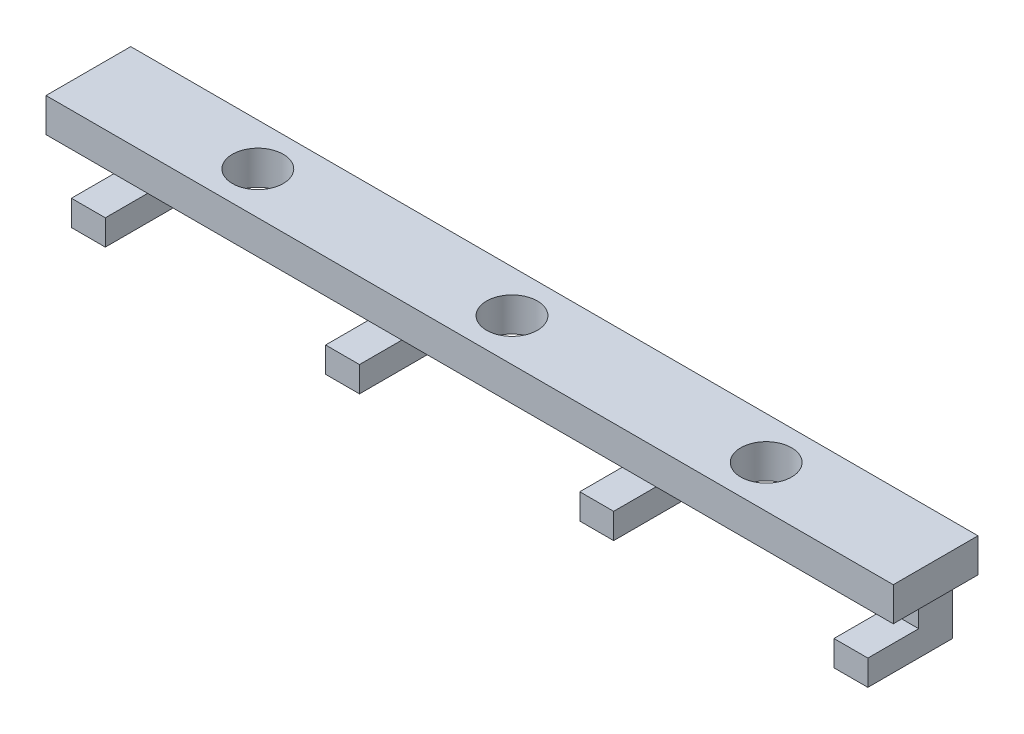
ISO-10303-21;
HEADER;
FILE_DESCRIPTION(('STEP AP214'),'2;1');
FILE_NAME('part.step','',(''),(''),'','','');
FILE_SCHEMA(('AUTOMOTIVE_DESIGN { 1 0 10303 214 1 1 1 1 }'));
ENDSEC;
DATA;
#1=APPLICATION_CONTEXT('core data for automotive mechanical design processes');
#2=APPLICATION_PROTOCOL_DEFINITION('international standard','automotive_design',2000,#1);
#3=PRODUCT_CONTEXT('',#1,'mechanical');
#4=PRODUCT('Part','Part','',(#3));
#5=PRODUCT_RELATED_PRODUCT_CATEGORY('part','',(#4));
#6=PRODUCT_DEFINITION_FORMATION('','',#4);
#7=PRODUCT_DEFINITION_CONTEXT('part definition',#1,'design');
#8=PRODUCT_DEFINITION('design','',#6,#7);
#9=PRODUCT_DEFINITION_SHAPE('','',#8);
#10=(LENGTH_UNIT() NAMED_UNIT(*) SI_UNIT(.MILLI.,.METRE.));
#11=(NAMED_UNIT(*) PLANE_ANGLE_UNIT() SI_UNIT($,.RADIAN.));
#12=(NAMED_UNIT(*) SI_UNIT($,.STERADIAN.) SOLID_ANGLE_UNIT());
#13=UNCERTAINTY_MEASURE_WITH_UNIT(LENGTH_MEASURE(1.E-05),#10,'distance_accuracy_value','');
#14=(GEOMETRIC_REPRESENTATION_CONTEXT(3) GLOBAL_UNCERTAINTY_ASSIGNED_CONTEXT((#13)) GLOBAL_UNIT_ASSIGNED_CONTEXT((#10,
#11,#12)) REPRESENTATION_CONTEXT('',''));
#15=CARTESIAN_POINT('',(0.,0.,0.));
#16=DIRECTION('',(0.,0.,1.));
#17=DIRECTION('',(1.,0.,0.));
#18=AXIS2_PLACEMENT_3D('',#15,#16,#17);
#19=CARTESIAN_POINT('',(-31.75,2.54,3.175));
#20=DIRECTION('',(0.,0.,-1.));
#21=DIRECTION('',(-1.,0.,0.));
#22=AXIS2_PLACEMENT_3D('',#19,#20,#21);
#23=PLANE('',#22);
#24=DIRECTION('',(1.,0.,0.));
#25=VECTOR('',#24,1.);
#26=CARTESIAN_POINT('',(-31.75,0.,3.175));
#27=LINE('',#26,#25);
#28=CARTESIAN_POINT('',(-31.75,0.,3.175));
#29=VERTEX_POINT('',#28);
#30=CARTESIAN_POINT('',(31.75,0.,3.175));
#31=VERTEX_POINT('',#30);
#32=EDGE_CURVE('E373',#29,#31,#27,.T.);
#33=ORIENTED_EDGE('',*,*,#32,.T.);
#34=DIRECTION('',(0.,-1.,0.));
#35=VECTOR('',#34,1.);
#36=CARTESIAN_POINT('',(31.75,2.54,3.175));
#37=LINE('',#36,#35);
#38=CARTESIAN_POINT('',(31.75,2.54,3.175));
#39=VERTEX_POINT('',#38);
#40=EDGE_CURVE('E379',#39,#31,#37,.T.);
#41=ORIENTED_EDGE('',*,*,#40,.F.);
#42=DIRECTION('',(1.,0.,0.));
#43=VECTOR('',#42,1.);
#44=CARTESIAN_POINT('',(-31.75,2.54,3.175));
#45=LINE('',#44,#43);
#46=CARTESIAN_POINT('',(-31.75,2.54,3.175));
#47=VERTEX_POINT('',#46);
#48=EDGE_CURVE('E377',#47,#39,#45,.T.);
#49=ORIENTED_EDGE('',*,*,#48,.F.);
#50=DIRECTION('',(0.,-1.,0.));
#51=VECTOR('',#50,1.);
#52=CARTESIAN_POINT('',(-31.75,2.54,3.175));
#53=LINE('',#52,#51);
#54=EDGE_CURVE('E391',#47,#29,#53,.T.);
#55=ORIENTED_EDGE('',*,*,#54,.T.);
#56=EDGE_LOOP('',(#33,#41,#49,#55));
#57=FACE_BOUND('',#56,.T.);
#58=ADVANCED_FACE('F42',(#57),#23,.F.);
#59=DIRECTION('',(0.,1.,0.));
#60=VECTOR('',#59,1.);
#61=CARTESIAN_POINT('',(29.845,-5.08,3.175));
#62=LINE('',#61,#60);
#63=CARTESIAN_POINT('',(29.845,-5.08,3.175));
#64=VERTEX_POINT('',#63);
#65=CARTESIAN_POINT('',(29.845,-3.175,3.175));
#66=VERTEX_POINT('',#65);
#67=EDGE_CURVE('E335',#64,#66,#62,.T.);
#68=ORIENTED_EDGE('',*,*,#67,.T.);
#69=DIRECTION('',(1.,0.,0.));
#70=VECTOR('',#69,1.);
#71=CARTESIAN_POINT('',(-31.75,-3.175,3.175));
#72=LINE('',#71,#70);
#73=CARTESIAN_POINT('',(27.305,-3.175,3.175));
#74=VERTEX_POINT('',#73);
#75=EDGE_CURVE('E250',#74,#66,#72,.T.);
#76=ORIENTED_EDGE('',*,*,#75,.F.);
#77=DIRECTION('',(0.,1.,0.));
#78=VECTOR('',#77,1.);
#79=CARTESIAN_POINT('',(27.305,-5.08,3.175));
#80=LINE('',#79,#78);
#81=CARTESIAN_POINT('',(27.305,-5.08,3.175));
#82=VERTEX_POINT('',#81);
#83=EDGE_CURVE('E325',#82,#74,#80,.T.);
#84=ORIENTED_EDGE('',*,*,#83,.F.);
#85=DIRECTION('',(-1.,0.,0.));
#86=VECTOR('',#85,1.);
#87=CARTESIAN_POINT('',(29.845,-5.08,3.175));
#88=LINE('',#87,#86);
#89=EDGE_CURVE('E342',#64,#82,#88,.T.);
#90=ORIENTED_EDGE('',*,*,#89,.F.);
#91=EDGE_LOOP('',(#68,#76,#84,#90));
#92=FACE_BOUND('',#91,.T.);
#93=ADVANCED_FACE('F540',(#92),#23,.F.);
#94=DIRECTION('',(0.,1.,0.));
#95=VECTOR('',#94,1.);
#96=CARTESIAN_POINT('',(10.795,-5.08,3.175));
#97=LINE('',#96,#95);
#98=CARTESIAN_POINT('',(10.795,-5.08,3.175));
#99=VERTEX_POINT('',#98);
#100=CARTESIAN_POINT('',(10.795,-3.175,3.175));
#101=VERTEX_POINT('',#100);
#102=EDGE_CURVE('E309',#99,#101,#97,.T.);
#103=ORIENTED_EDGE('',*,*,#102,.T.);
#104=CARTESIAN_POINT('',(8.255,-3.175,3.175));
#105=VERTEX_POINT('',#104);
#106=EDGE_CURVE('E452',#105,#101,#72,.T.);
#107=ORIENTED_EDGE('',*,*,#106,.F.);
#108=DIRECTION('',(0.,1.,0.));
#109=VECTOR('',#108,1.);
#110=CARTESIAN_POINT('',(8.255,-5.08,3.175));
#111=LINE('',#110,#109);
#112=CARTESIAN_POINT('',(8.255,-5.08,3.175));
#113=VERTEX_POINT('',#112);
#114=EDGE_CURVE('E299',#113,#105,#111,.T.);
#115=ORIENTED_EDGE('',*,*,#114,.F.);
#116=DIRECTION('',(-1.,0.,0.));
#117=VECTOR('',#116,1.);
#118=CARTESIAN_POINT('',(10.795,-5.08,3.175));
#119=LINE('',#118,#117);
#120=EDGE_CURVE('E316',#99,#113,#119,.T.);
#121=ORIENTED_EDGE('',*,*,#120,.F.);
#122=EDGE_LOOP('',(#103,#107,#115,#121));
#123=FACE_BOUND('',#122,.T.);
#124=ADVANCED_FACE('F537',(#123),#23,.F.);
#125=DIRECTION('',(0.,1.,0.));
#126=VECTOR('',#125,1.);
#127=CARTESIAN_POINT('',(-8.255,-5.08,3.175));
#128=LINE('',#127,#126);
#129=CARTESIAN_POINT('',(-8.255,-5.08,3.175));
#130=VERTEX_POINT('',#129);
#131=CARTESIAN_POINT('',(-8.255,-3.175,3.175));
#132=VERTEX_POINT('',#131);
#133=EDGE_CURVE('E281',#130,#132,#128,.T.);
#134=ORIENTED_EDGE('',*,*,#133,.T.);
#135=CARTESIAN_POINT('',(-10.795,-3.175,3.175));
#136=VERTEX_POINT('',#135);
#137=EDGE_CURVE('E248',#136,#132,#72,.T.);
#138=ORIENTED_EDGE('',*,*,#137,.F.);
#139=DIRECTION('',(0.,1.,0.));
#140=VECTOR('',#139,1.);
#141=CARTESIAN_POINT('',(-10.795,-5.08,3.175));
#142=LINE('',#141,#140);
#143=CARTESIAN_POINT('',(-10.795,-5.08,3.175));
#144=VERTEX_POINT('',#143);
#145=EDGE_CURVE('E271',#144,#136,#142,.T.);
#146=ORIENTED_EDGE('',*,*,#145,.F.);
#147=DIRECTION('',(-1.,0.,0.));
#148=VECTOR('',#147,1.);
#149=CARTESIAN_POINT('',(-8.255,-5.08,3.175));
#150=LINE('',#149,#148);
#151=EDGE_CURVE('E289',#130,#144,#150,.T.);
#152=ORIENTED_EDGE('',*,*,#151,.F.);
#153=EDGE_LOOP('',(#134,#138,#146,#152));
#154=FACE_BOUND('',#153,.T.);
#155=ADVANCED_FACE('F539',(#154),#23,.F.);
#156=CARTESIAN_POINT('',(0.,2.54,0.));
#157=DIRECTION('',(0.,-1.,0.));
#158=DIRECTION('',(0.,0.,-1.));
#159=AXIS2_PLACEMENT_3D('',#156,#157,#158);
#160=PLANE('',#159);
#161=DIRECTION('',(0.,0.,-1.));
#162=VECTOR('',#161,1.);
#163=CARTESIAN_POINT('',(31.75,2.54,3.175));
#164=LINE('',#163,#162);
#165=CARTESIAN_POINT('',(31.75,2.54,-3.175));
#166=VERTEX_POINT('',#165);
#167=EDGE_CURVE('E369',#39,#166,#164,.T.);
#168=ORIENTED_EDGE('',*,*,#167,.T.);
#169=DIRECTION('',(-1.,0.,0.));
#170=VECTOR('',#169,1.);
#171=CARTESIAN_POINT('',(-31.75,2.54,-3.175));
#172=LINE('',#171,#170);
#173=CARTESIAN_POINT('',(-31.75,2.54,-3.175));
#174=VERTEX_POINT('',#173);
#175=EDGE_CURVE('E372',#166,#174,#172,.T.);
#176=ORIENTED_EDGE('',*,*,#175,.T.);
#177=DIRECTION('',(0.,0.,1.));
#178=VECTOR('',#177,1.);
#179=CARTESIAN_POINT('',(-31.75,2.54,3.175));
#180=LINE('',#179,#178);
#181=EDGE_CURVE('E375',#174,#47,#180,.T.);
#182=ORIENTED_EDGE('',*,*,#181,.T.);
#183=ORIENTED_EDGE('',*,*,#48,.T.);
#184=EDGE_LOOP('',(#168,#176,#182,#183));
#185=FACE_BOUND('',#184,.T.);
#186=CARTESIAN_POINT('',(0.,2.54,0.));
#187=DIRECTION('',(0.,1.,0.));
#188=DIRECTION('',(0.,0.,1.));
#189=AXIS2_PLACEMENT_3D('',#186,#187,#188);
#190=CIRCLE('',#189,1.905);
#191=CARTESIAN_POINT('',(0.,2.54,1.905));
#192=VERTEX_POINT('',#191);
#193=EDGE_CURVE('E363',#192,#192,#190,.T.);
#194=ORIENTED_EDGE('',*,*,#193,.F.);
#195=EDGE_LOOP('',(#194));
#196=FACE_BOUND('',#195,.T.);
#197=CARTESIAN_POINT('',(-19.05,2.54,0.));
#198=DIRECTION('',(0.,1.,0.));
#199=DIRECTION('',(0.,0.,1.));
#200=AXIS2_PLACEMENT_3D('',#197,#198,#199);
#201=CIRCLE('',#200,1.905);
#202=CARTESIAN_POINT('',(-19.05,2.54,1.905));
#203=VERTEX_POINT('',#202);
#204=EDGE_CURVE('E357',#203,#203,#201,.T.);
#205=ORIENTED_EDGE('',*,*,#204,.F.);
#206=EDGE_LOOP('',(#205));
#207=FACE_BOUND('',#206,.T.);
#208=CARTESIAN_POINT('',(19.05,2.54,0.));
#209=DIRECTION('',(0.,1.,0.));
#210=DIRECTION('',(0.,0.,-1.));
#211=AXIS2_PLACEMENT_3D('',#208,#209,#210);
#212=CIRCLE('',#211,1.905);
#213=CARTESIAN_POINT('',(19.05,2.54,-1.905));
#214=VERTEX_POINT('',#213);
#215=EDGE_CURVE('E351',#214,#214,#212,.T.);
#216=ORIENTED_EDGE('',*,*,#215,.F.);
#217=EDGE_LOOP('',(#216));
#218=FACE_BOUND('',#217,.T.);
#219=ADVANCED_FACE('F497',(#185,#196,#207,#218),#160,.F.);
#220=CARTESIAN_POINT('',(0.,0.,0.));
#221=DIRECTION('',(0.,-1.,0.));
#222=DIRECTION('',(0.,0.,-1.));
#223=AXIS2_PLACEMENT_3D('',#220,#221,#222);
#224=PLANE('',#223);
#225=CARTESIAN_POINT('',(0.,0.,0.));
#226=DIRECTION('',(0.,1.,0.));
#227=DIRECTION('',(0.,0.,1.));
#228=AXIS2_PLACEMENT_3D('',#225,#226,#227);
#229=CIRCLE('',#228,1.905);
#230=CARTESIAN_POINT('',(0.,0.,1.905));
#231=VERTEX_POINT('',#230);
#232=EDGE_CURVE('E360',#231,#231,#229,.T.);
#233=ORIENTED_EDGE('',*,*,#232,.T.);
#234=EDGE_LOOP('',(#233));
#235=FACE_BOUND('',#234,.T.);
#236=CARTESIAN_POINT('',(19.05,0.,0.));
#237=DIRECTION('',(0.,1.,0.));
#238=DIRECTION('',(0.,0.,-1.));
#239=AXIS2_PLACEMENT_3D('',#236,#237,#238);
#240=CIRCLE('',#239,1.905);
#241=CARTESIAN_POINT('',(19.05,0.,-1.905));
#242=VERTEX_POINT('',#241);
#243=EDGE_CURVE('E270',#242,#242,#240,.T.);
#244=ORIENTED_EDGE('',*,*,#243,.T.);
#245=EDGE_LOOP('',(#244));
#246=FACE_BOUND('',#245,.T.);
#247=CARTESIAN_POINT('',(-19.05,0.,0.));
#248=DIRECTION('',(0.,1.,0.));
#249=DIRECTION('',(0.,0.,1.));
#250=AXIS2_PLACEMENT_3D('',#247,#248,#249);
#251=CIRCLE('',#250,1.905);
#252=CARTESIAN_POINT('',(-19.05,0.,1.905));
#253=VERTEX_POINT('',#252);
#254=EDGE_CURVE('E354',#253,#253,#251,.T.);
#255=ORIENTED_EDGE('',*,*,#254,.T.);
#256=EDGE_LOOP('',(#255));
#257=FACE_BOUND('',#256,.T.);
#258=DIRECTION('',(0.,0.,-1.));
#259=VECTOR('',#258,1.);
#260=CARTESIAN_POINT('',(-10.795,0.,-3.175));
#261=LINE('',#260,#259);
#262=CARTESIAN_POINT('',(-10.795,0.,-0.634999999999999));
#263=VERTEX_POINT('',#262);
#264=CARTESIAN_POINT('',(-10.795,0.,-3.175));
#265=VERTEX_POINT('',#264);
#266=EDGE_CURVE('E288',#263,#265,#261,.T.);
#267=ORIENTED_EDGE('',*,*,#266,.F.);
#268=DIRECTION('',(-1.,0.,0.));
#269=VECTOR('',#268,1.);
#270=CARTESIAN_POINT('',(-31.75,0.,-0.634999999999999));
#271=LINE('',#270,#269);
#272=CARTESIAN_POINT('',(-8.255,0.,-0.634999999999999));
#273=VERTEX_POINT('',#272);
#274=EDGE_CURVE('E413',#273,#263,#271,.T.);
#275=ORIENTED_EDGE('',*,*,#274,.F.);
#276=DIRECTION('',(0.,0.,1.));
#277=VECTOR('',#276,1.);
#278=CARTESIAN_POINT('',(-8.255,0.,-3.175));
#279=LINE('',#278,#277);
#280=CARTESIAN_POINT('',(-8.255,0.,-3.175));
#281=VERTEX_POINT('',#280);
#282=EDGE_CURVE('E285',#281,#273,#279,.T.);
#283=ORIENTED_EDGE('',*,*,#282,.F.);
#284=DIRECTION('',(-1.,0.,0.));
#285=VECTOR('',#284,1.);
#286=CARTESIAN_POINT('',(-31.75,0.,-3.175));
#287=LINE('',#286,#285);
#288=CARTESIAN_POINT('',(8.255,0.,-3.175));
#289=VERTEX_POINT('',#288);
#290=EDGE_CURVE('E473',#289,#281,#287,.T.);
#291=ORIENTED_EDGE('',*,*,#290,.F.);
#292=DIRECTION('',(0.,0.,-1.));
#293=VECTOR('',#292,1.);
#294=CARTESIAN_POINT('',(8.255,0.,-3.175));
#295=LINE('',#294,#293);
#296=CARTESIAN_POINT('',(8.255,0.,-0.634999999999999));
#297=VERTEX_POINT('',#296);
#298=EDGE_CURVE('E275',#297,#289,#295,.T.);
#299=ORIENTED_EDGE('',*,*,#298,.F.);
#300=CARTESIAN_POINT('',(10.795,0.,-0.634999999999999));
#301=VERTEX_POINT('',#300);
#302=EDGE_CURVE('E519',#301,#297,#271,.T.);
#303=ORIENTED_EDGE('',*,*,#302,.F.);
#304=DIRECTION('',(0.,0.,1.));
#305=VECTOR('',#304,1.);
#306=CARTESIAN_POINT('',(10.795,0.,-3.175));
#307=LINE('',#306,#305);
#308=CARTESIAN_POINT('',(10.795,0.,-3.175));
#309=VERTEX_POINT('',#308);
#310=EDGE_CURVE('E313',#309,#301,#307,.T.);
#311=ORIENTED_EDGE('',*,*,#310,.F.);
#312=CARTESIAN_POINT('',(27.305,0.,-3.175));
#313=VERTEX_POINT('',#312);
#314=EDGE_CURVE('E386',#313,#309,#287,.T.);
#315=ORIENTED_EDGE('',*,*,#314,.F.);
#316=DIRECTION('',(0.,0.,-1.));
#317=VECTOR('',#316,1.);
#318=CARTESIAN_POINT('',(27.305,0.,-3.175));
#319=LINE('',#318,#317);
#320=CARTESIAN_POINT('',(27.305,0.,-0.634999999999999));
#321=VERTEX_POINT('',#320);
#322=EDGE_CURVE('E303',#321,#313,#319,.T.);
#323=ORIENTED_EDGE('',*,*,#322,.F.);
#324=CARTESIAN_POINT('',(29.845,0.,-0.634999999999999));
#325=VERTEX_POINT('',#324);
#326=EDGE_CURVE('E415',#325,#321,#271,.T.);
#327=ORIENTED_EDGE('',*,*,#326,.F.);
#328=DIRECTION('',(0.,0.,1.));
#329=VECTOR('',#328,1.);
#330=CARTESIAN_POINT('',(29.845,0.,-3.175));
#331=LINE('',#330,#329);
#332=CARTESIAN_POINT('',(29.845,0.,-3.175));
#333=VERTEX_POINT('',#332);
#334=EDGE_CURVE('E339',#333,#325,#331,.T.);
#335=ORIENTED_EDGE('',*,*,#334,.F.);
#336=CARTESIAN_POINT('',(31.75,0.,-3.175));
#337=VERTEX_POINT('',#336);
#338=EDGE_CURVE('E382',#337,#333,#287,.T.);
#339=ORIENTED_EDGE('',*,*,#338,.F.);
#340=DIRECTION('',(0.,0.,-1.));
#341=VECTOR('',#340,1.);
#342=CARTESIAN_POINT('',(31.75,0.,3.175));
#343=LINE('',#342,#341);
#344=EDGE_CURVE('E366',#31,#337,#343,.T.);
#345=ORIENTED_EDGE('',*,*,#344,.F.);
#346=ORIENTED_EDGE('',*,*,#32,.F.);
#347=DIRECTION('',(0.,0.,1.));
#348=VECTOR('',#347,1.);
#349=CARTESIAN_POINT('',(-31.75,0.,3.175));
#350=LINE('',#349,#348);
#351=CARTESIAN_POINT('',(-31.75,0.,-3.175));
#352=VERTEX_POINT('',#351);
#353=EDGE_CURVE('E385',#352,#29,#350,.T.);
#354=ORIENTED_EDGE('',*,*,#353,.F.);
#355=CARTESIAN_POINT('',(-29.845,0.,-3.175));
#356=VERTEX_POINT('',#355);
#357=EDGE_CURVE('E381',#356,#352,#287,.T.);
#358=ORIENTED_EDGE('',*,*,#357,.F.);
#359=DIRECTION('',(0.,0.,-1.));
#360=VECTOR('',#359,1.);
#361=CARTESIAN_POINT('',(-29.845,0.,-3.175));
#362=LINE('',#361,#360);
#363=CARTESIAN_POINT('',(-29.845,0.,-0.634999999999999));
#364=VERTEX_POINT('',#363);
#365=EDGE_CURVE('E291',#364,#356,#362,.T.);
#366=ORIENTED_EDGE('',*,*,#365,.F.);
#367=CARTESIAN_POINT('',(-27.305,0.,-0.634999999999999));
#368=VERTEX_POINT('',#367);
#369=EDGE_CURVE('E403',#368,#364,#271,.T.);
#370=ORIENTED_EDGE('',*,*,#369,.F.);
#371=DIRECTION('',(0.,0.,1.));
#372=VECTOR('',#371,1.);
#373=CARTESIAN_POINT('',(-27.305,0.,-3.175));
#374=LINE('',#373,#372);
#375=CARTESIAN_POINT('',(-27.305,0.,-3.175));
#376=VERTEX_POINT('',#375);
#377=EDGE_CURVE('E262',#376,#368,#374,.T.);
#378=ORIENTED_EDGE('',*,*,#377,.F.);
#379=EDGE_CURVE('E479',#265,#376,#287,.T.);
#380=ORIENTED_EDGE('',*,*,#379,.F.);
#381=EDGE_LOOP('',(#267,#275,#283,#291,#299,#303,#311,#315,#323,#327,#335,#339,#345,#346,#354,
#358,#366,#370,#378,#380));
#382=FACE_BOUND('',#381,.T.);
#383=ADVANCED_FACE('F409',(#235,#246,#257,#382),#224,.T.);
#384=CARTESIAN_POINT('',(31.75,2.54,3.175));
#385=DIRECTION('',(-1.,0.,0.));
#386=DIRECTION('',(0.,0.,1.));
#387=AXIS2_PLACEMENT_3D('',#384,#385,#386);
#388=PLANE('',#387);
#389=ORIENTED_EDGE('',*,*,#344,.T.);
#390=DIRECTION('',(0.,-1.,0.));
#391=VECTOR('',#390,1.);
#392=CARTESIAN_POINT('',(31.75,2.54,-3.175));
#393=LINE('',#392,#391);
#394=EDGE_CURVE('E397',#166,#337,#393,.T.);
#395=ORIENTED_EDGE('',*,*,#394,.F.);
#396=ORIENTED_EDGE('',*,*,#167,.F.);
#397=ORIENTED_EDGE('',*,*,#40,.T.);
#398=EDGE_LOOP('',(#389,#395,#396,#397));
#399=FACE_BOUND('',#398,.T.);
#400=ADVANCED_FACE('F44',(#399),#388,.F.);
#401=CARTESIAN_POINT('',(-31.75,2.54,-3.175));
#402=DIRECTION('',(0.,0.,1.));
#403=DIRECTION('',(1.,0.,0.));
#404=AXIS2_PLACEMENT_3D('',#401,#402,#403);
#405=PLANE('',#404);
#406=ORIENTED_EDGE('',*,*,#338,.T.);
#407=DIRECTION('',(0.,1.,0.));
#408=VECTOR('',#407,1.);
#409=CARTESIAN_POINT('',(29.845,-5.08,-3.175));
#410=LINE('',#409,#408);
#411=CARTESIAN_POINT('',(29.845,-5.08,-3.175));
#412=VERTEX_POINT('',#411);
#413=EDGE_CURVE('E332',#412,#333,#410,.T.);
#414=ORIENTED_EDGE('',*,*,#413,.F.);
#415=DIRECTION('',(1.,0.,0.));
#416=VECTOR('',#415,1.);
#417=CARTESIAN_POINT('',(29.845,-5.08,-3.175));
#418=LINE('',#417,#416);
#419=CARTESIAN_POINT('',(27.305,-5.08,-3.175));
#420=VERTEX_POINT('',#419);
#421=EDGE_CURVE('E345',#420,#412,#418,.T.);
#422=ORIENTED_EDGE('',*,*,#421,.F.);
#423=DIRECTION('',(0.,1.,0.));
#424=VECTOR('',#423,1.);
#425=CARTESIAN_POINT('',(27.305,-5.08,-3.175));
#426=LINE('',#425,#424);
#427=EDGE_CURVE('E328',#420,#313,#426,.T.);
#428=ORIENTED_EDGE('',*,*,#427,.T.);
#429=ORIENTED_EDGE('',*,*,#314,.T.);
#430=DIRECTION('',(0.,1.,0.));
#431=VECTOR('',#430,1.);
#432=CARTESIAN_POINT('',(10.795,-5.08,-3.175));
#433=LINE('',#432,#431);
#434=CARTESIAN_POINT('',(10.795,-5.08,-3.175));
#435=VERTEX_POINT('',#434);
#436=EDGE_CURVE('E306',#435,#309,#433,.T.);
#437=ORIENTED_EDGE('',*,*,#436,.F.);
#438=DIRECTION('',(1.,0.,0.));
#439=VECTOR('',#438,1.);
#440=CARTESIAN_POINT('',(10.795,-5.08,-3.175));
#441=LINE('',#440,#439);
#442=CARTESIAN_POINT('',(8.255,-5.08,-3.175));
#443=VERTEX_POINT('',#442);
#444=EDGE_CURVE('E319',#443,#435,#441,.T.);
#445=ORIENTED_EDGE('',*,*,#444,.F.);
#446=DIRECTION('',(0.,1.,0.));
#447=VECTOR('',#446,1.);
#448=CARTESIAN_POINT('',(8.255,-5.08,-3.175));
#449=LINE('',#448,#447);
#450=EDGE_CURVE('E302',#443,#289,#449,.T.);
#451=ORIENTED_EDGE('',*,*,#450,.T.);
#452=ORIENTED_EDGE('',*,*,#290,.T.);
#453=DIRECTION('',(0.,1.,0.));
#454=VECTOR('',#453,1.);
#455=CARTESIAN_POINT('',(-8.255,-5.08,-3.175));
#456=LINE('',#455,#454);
#457=CARTESIAN_POINT('',(-8.255,-5.08,-3.175));
#458=VERTEX_POINT('',#457);
#459=EDGE_CURVE('E278',#458,#281,#456,.T.);
#460=ORIENTED_EDGE('',*,*,#459,.F.);
#461=DIRECTION('',(1.,0.,0.));
#462=VECTOR('',#461,1.);
#463=CARTESIAN_POINT('',(-8.255,-5.08,-3.175));
#464=LINE('',#463,#462);
#465=CARTESIAN_POINT('',(-10.795,-5.08,-3.175));
#466=VERTEX_POINT('',#465);
#467=EDGE_CURVE('E293',#466,#458,#464,.T.);
#468=ORIENTED_EDGE('',*,*,#467,.F.);
#469=DIRECTION('',(0.,1.,0.));
#470=VECTOR('',#469,1.);
#471=CARTESIAN_POINT('',(-10.795,-5.08,-3.175));
#472=LINE('',#471,#470);
#473=EDGE_CURVE('E274',#466,#265,#472,.T.);
#474=ORIENTED_EDGE('',*,*,#473,.T.);
#475=ORIENTED_EDGE('',*,*,#379,.T.);
#476=DIRECTION('',(0.,1.,0.));
#477=VECTOR('',#476,1.);
#478=CARTESIAN_POINT('',(-27.305,-5.08,-3.175));
#479=LINE('',#478,#477);
#480=CARTESIAN_POINT('',(-27.305,-5.08,-3.175));
#481=VERTEX_POINT('',#480);
#482=EDGE_CURVE('E257',#481,#376,#479,.T.);
#483=ORIENTED_EDGE('',*,*,#482,.F.);
#484=DIRECTION('',(1.,0.,0.));
#485=VECTOR('',#484,1.);
#486=CARTESIAN_POINT('',(-27.305,-5.08,-3.175));
#487=LINE('',#486,#485);
#488=CARTESIAN_POINT('',(-29.845,-5.08,-3.175));
#489=VERTEX_POINT('',#488);
#490=EDGE_CURVE('E419',#489,#481,#487,.T.);
#491=ORIENTED_EDGE('',*,*,#490,.F.);
#492=DIRECTION('',(0.,1.,0.));
#493=VECTOR('',#492,1.);
#494=CARTESIAN_POINT('',(-29.845,-5.08,-3.175));
#495=LINE('',#494,#493);
#496=EDGE_CURVE('E267',#489,#356,#495,.T.);
#497=ORIENTED_EDGE('',*,*,#496,.T.);
#498=ORIENTED_EDGE('',*,*,#357,.T.);
#499=DIRECTION('',(0.,-1.,0.));
#500=VECTOR('',#499,1.);
#501=CARTESIAN_POINT('',(-31.75,2.54,-3.175));
#502=LINE('',#501,#500);
#503=EDGE_CURVE('E394',#174,#352,#502,.T.);
#504=ORIENTED_EDGE('',*,*,#503,.F.);
#505=ORIENTED_EDGE('',*,*,#175,.F.);
#506=ORIENTED_EDGE('',*,*,#394,.T.);
#507=EDGE_LOOP('',(#406,#414,#422,#428,#429,#437,#445,#451,#452,#460,#468,#474,#475,#483,#491,
#497,#498,#504,#505,#506));
#508=FACE_BOUND('',#507,.T.);
#509=ADVANCED_FACE('F475',(#508),#405,.F.);
#510=CARTESIAN_POINT('',(-31.75,2.54,3.175));
#511=DIRECTION('',(1.,0.,0.));
#512=DIRECTION('',(0.,0.,-1.));
#513=AXIS2_PLACEMENT_3D('',#510,#511,#512);
#514=PLANE('',#513);
#515=ORIENTED_EDGE('',*,*,#353,.T.);
#516=ORIENTED_EDGE('',*,*,#54,.F.);
#517=ORIENTED_EDGE('',*,*,#181,.F.);
#518=ORIENTED_EDGE('',*,*,#503,.T.);
#519=EDGE_LOOP('',(#515,#516,#517,#518));
#520=FACE_BOUND('',#519,.T.);
#521=ADVANCED_FACE('F485',(#520),#514,.F.);
#522=DIRECTION('',(0.,1.,0.));
#523=VECTOR('',#522,1.);
#524=CARTESIAN_POINT('',(-27.305,-5.08,3.175));
#525=LINE('',#524,#523);
#526=CARTESIAN_POINT('',(-27.305,-5.08,3.175));
#527=VERTEX_POINT('',#526);
#528=CARTESIAN_POINT('',(-27.305,-3.175,3.175));
#529=VERTEX_POINT('',#528);
#530=EDGE_CURVE('E247',#527,#529,#525,.T.);
#531=ORIENTED_EDGE('',*,*,#530,.T.);
#532=CARTESIAN_POINT('',(-29.845,-3.175,3.175));
#533=VERTEX_POINT('',#532);
#534=EDGE_CURVE('E231',#533,#529,#72,.T.);
#535=ORIENTED_EDGE('',*,*,#534,.F.);
#536=DIRECTION('',(0.,1.,0.));
#537=VECTOR('',#536,1.);
#538=CARTESIAN_POINT('',(-29.845,-5.08,3.175));
#539=LINE('',#538,#537);
#540=CARTESIAN_POINT('',(-29.845,-5.08,3.175));
#541=VERTEX_POINT('',#540);
#542=EDGE_CURVE('E244',#541,#533,#539,.T.);
#543=ORIENTED_EDGE('',*,*,#542,.F.);
#544=DIRECTION('',(-1.,0.,0.));
#545=VECTOR('',#544,1.);
#546=CARTESIAN_POINT('',(-27.305,-5.08,3.175));
#547=LINE('',#546,#545);
#548=EDGE_CURVE('E255',#527,#541,#547,.T.);
#549=ORIENTED_EDGE('',*,*,#548,.F.);
#550=EDGE_LOOP('',(#531,#535,#543,#549));
#551=FACE_BOUND('',#550,.T.);
#552=ADVANCED_FACE('F242',(#551),#23,.F.);
#553=CARTESIAN_POINT('',(0.,2.54,0.));
#554=DIRECTION('',(0.,-1.,0.));
#555=DIRECTION('',(0.,0.,-1.));
#556=AXIS2_PLACEMENT_3D('',#553,#554,#555);
#557=CYLINDRICAL_SURFACE('',#556,1.905);
#558=ORIENTED_EDGE('',*,*,#193,.T.);
#559=EDGE_LOOP('',(#558));
#560=FACE_BOUND('',#559,.T.);
#561=ORIENTED_EDGE('',*,*,#232,.F.);
#562=EDGE_LOOP('',(#561));
#563=FACE_BOUND('',#562,.T.);
#564=ADVANCED_FACE('F555',(#560,#563),#557,.F.);
#565=CARTESIAN_POINT('',(-19.05,2.54,0.));
#566=DIRECTION('',(0.,-1.,0.));
#567=DIRECTION('',(0.,0.,-1.));
#568=AXIS2_PLACEMENT_3D('',#565,#566,#567);
#569=CYLINDRICAL_SURFACE('',#568,1.905);
#570=ORIENTED_EDGE('',*,*,#204,.T.);
#571=EDGE_LOOP('',(#570));
#572=FACE_BOUND('',#571,.T.);
#573=ORIENTED_EDGE('',*,*,#254,.F.);
#574=EDGE_LOOP('',(#573));
#575=FACE_BOUND('',#574,.T.);
#576=ADVANCED_FACE('F560',(#572,#575),#569,.F.);
#577=CARTESIAN_POINT('',(19.05,2.54,0.));
#578=DIRECTION('',(0.,-1.,0.));
#579=DIRECTION('',(0.,0.,-1.));
#580=AXIS2_PLACEMENT_3D('',#577,#578,#579);
#581=CYLINDRICAL_SURFACE('',#580,1.905);
#582=ORIENTED_EDGE('',*,*,#215,.T.);
#583=EDGE_LOOP('',(#582));
#584=FACE_BOUND('',#583,.T.);
#585=ORIENTED_EDGE('',*,*,#243,.F.);
#586=EDGE_LOOP('',(#585));
#587=FACE_BOUND('',#586,.T.);
#588=ADVANCED_FACE('F582',(#584,#587),#581,.F.);
#589=CARTESIAN_POINT('',(27.305,-5.08,-3.175));
#590=DIRECTION('',(1.,0.,0.));
#591=DIRECTION('',(0.,0.,-1.));
#592=AXIS2_PLACEMENT_3D('',#589,#590,#591);
#593=PLANE('',#592);
#594=ORIENTED_EDGE('',*,*,#83,.T.);
#595=DIRECTION('',(0.,0.,-1.));
#596=VECTOR('',#595,1.);
#597=CARTESIAN_POINT('',(27.305,-3.175,-3.175));
#598=LINE('',#597,#596);
#599=CARTESIAN_POINT('',(27.305,-3.175,-0.634999999999999));
#600=VERTEX_POINT('',#599);
#601=EDGE_CURVE('E329',#74,#600,#598,.T.);
#602=ORIENTED_EDGE('',*,*,#601,.T.);
#603=DIRECTION('',(0.,-1.,0.));
#604=VECTOR('',#603,1.);
#605=CARTESIAN_POINT('',(27.305,-5.08,-0.634999999999999));
#606=LINE('',#605,#604);
#607=EDGE_CURVE('E237',#321,#600,#606,.T.);
#608=ORIENTED_EDGE('',*,*,#607,.F.);
#609=ORIENTED_EDGE('',*,*,#322,.T.);
#610=ORIENTED_EDGE('',*,*,#427,.F.);
#611=DIRECTION('',(0.,0.,-1.));
#612=VECTOR('',#611,1.);
#613=CARTESIAN_POINT('',(27.305,-5.08,-3.175));
#614=LINE('',#613,#612);
#615=EDGE_CURVE('E347',#82,#420,#614,.T.);
#616=ORIENTED_EDGE('',*,*,#615,.F.);
#617=EDGE_LOOP('',(#594,#602,#608,#609,#610,#616));
#618=FACE_BOUND('',#617,.T.);
#619=ADVANCED_FACE('F514',(#618),#593,.F.);
#620=CARTESIAN_POINT('',(29.845,-5.08,-3.175));
#621=DIRECTION('',(-1.,0.,0.));
#622=DIRECTION('',(0.,0.,1.));
#623=AXIS2_PLACEMENT_3D('',#620,#621,#622);
#624=PLANE('',#623);
#625=DIRECTION('',(0.,1.,0.));
#626=VECTOR('',#625,1.);
#627=CARTESIAN_POINT('',(29.845,-5.08,-0.634999999999999));
#628=LINE('',#627,#626);
#629=CARTESIAN_POINT('',(29.845,-3.175,-0.634999999999999));
#630=VERTEX_POINT('',#629);
#631=EDGE_CURVE('E441',#630,#325,#628,.T.);
#632=ORIENTED_EDGE('',*,*,#631,.F.);
#633=DIRECTION('',(0.,0.,1.));
#634=VECTOR('',#633,1.);
#635=CARTESIAN_POINT('',(29.845,-3.175,-3.175));
#636=LINE('',#635,#634);
#637=EDGE_CURVE('E426',#630,#66,#636,.T.);
#638=ORIENTED_EDGE('',*,*,#637,.T.);
#639=ORIENTED_EDGE('',*,*,#67,.F.);
#640=DIRECTION('',(0.,0.,1.));
#641=VECTOR('',#640,1.);
#642=CARTESIAN_POINT('',(29.845,-5.08,-3.175));
#643=LINE('',#642,#641);
#644=EDGE_CURVE('E338',#412,#64,#643,.T.);
#645=ORIENTED_EDGE('',*,*,#644,.F.);
#646=ORIENTED_EDGE('',*,*,#413,.T.);
#647=ORIENTED_EDGE('',*,*,#334,.T.);
#648=EDGE_LOOP('',(#632,#638,#639,#645,#646,#647));
#649=FACE_BOUND('',#648,.T.);
#650=ADVANCED_FACE('F504',(#649),#624,.F.);
#651=CARTESIAN_POINT('',(0.,-5.08,0.));
#652=DIRECTION('',(0.,1.,0.));
#653=DIRECTION('',(0.,0.,1.));
#654=AXIS2_PLACEMENT_3D('',#651,#652,#653);
#655=PLANE('',#654);
#656=ORIENTED_EDGE('',*,*,#89,.T.);
#657=ORIENTED_EDGE('',*,*,#615,.T.);
#658=ORIENTED_EDGE('',*,*,#421,.T.);
#659=ORIENTED_EDGE('',*,*,#644,.T.);
#660=EDGE_LOOP('',(#656,#657,#658,#659));
#661=FACE_BOUND('',#660,.T.);
#662=ADVANCED_FACE('F508',(#661),#655,.F.);
#663=CARTESIAN_POINT('',(8.255,-5.08,-3.175));
#664=DIRECTION('',(1.,0.,0.));
#665=DIRECTION('',(0.,0.,-1.));
#666=AXIS2_PLACEMENT_3D('',#663,#664,#665);
#667=PLANE('',#666);
#668=ORIENTED_EDGE('',*,*,#114,.T.);
#669=DIRECTION('',(0.,0.,-1.));
#670=VECTOR('',#669,1.);
#671=CARTESIAN_POINT('',(8.255,-3.175,-3.175));
#672=LINE('',#671,#670);
#673=CARTESIAN_POINT('',(8.255,-3.175,-0.634999999999999));
#674=VERTEX_POINT('',#673);
#675=EDGE_CURVE('E429',#105,#674,#672,.T.);
#676=ORIENTED_EDGE('',*,*,#675,.T.);
#677=DIRECTION('',(0.,-1.,0.));
#678=VECTOR('',#677,1.);
#679=CARTESIAN_POINT('',(8.255,-5.08,-0.634999999999999));
#680=LINE('',#679,#678);
#681=EDGE_CURVE('E443',#297,#674,#680,.T.);
#682=ORIENTED_EDGE('',*,*,#681,.F.);
#683=ORIENTED_EDGE('',*,*,#298,.T.);
#684=ORIENTED_EDGE('',*,*,#450,.F.);
#685=DIRECTION('',(0.,0.,-1.));
#686=VECTOR('',#685,1.);
#687=CARTESIAN_POINT('',(8.255,-5.08,-3.175));
#688=LINE('',#687,#686);
#689=EDGE_CURVE('E321',#113,#443,#688,.T.);
#690=ORIENTED_EDGE('',*,*,#689,.F.);
#691=EDGE_LOOP('',(#668,#676,#682,#683,#684,#690));
#692=FACE_BOUND('',#691,.T.);
#693=ADVANCED_FACE('F530',(#692),#667,.F.);
#694=CARTESIAN_POINT('',(10.795,-5.08,-3.175));
#695=DIRECTION('',(-1.,0.,0.));
#696=DIRECTION('',(0.,0.,1.));
#697=AXIS2_PLACEMENT_3D('',#694,#695,#696);
#698=PLANE('',#697);
#699=DIRECTION('',(0.,1.,0.));
#700=VECTOR('',#699,1.);
#701=CARTESIAN_POINT('',(10.795,-5.08,-0.634999999999999));
#702=LINE('',#701,#700);
#703=CARTESIAN_POINT('',(10.795,-3.175,-0.634999999999999));
#704=VERTEX_POINT('',#703);
#705=EDGE_CURVE('E445',#704,#301,#702,.T.);
#706=ORIENTED_EDGE('',*,*,#705,.F.);
#707=DIRECTION('',(0.,0.,1.));
#708=VECTOR('',#707,1.);
#709=CARTESIAN_POINT('',(10.795,-3.175,-3.175));
#710=LINE('',#709,#708);
#711=EDGE_CURVE('E432',#704,#101,#710,.T.);
#712=ORIENTED_EDGE('',*,*,#711,.T.);
#713=ORIENTED_EDGE('',*,*,#102,.F.);
#714=DIRECTION('',(0.,0.,1.));
#715=VECTOR('',#714,1.);
#716=CARTESIAN_POINT('',(10.795,-5.08,-3.175));
#717=LINE('',#716,#715);
#718=EDGE_CURVE('E312',#435,#99,#717,.T.);
#719=ORIENTED_EDGE('',*,*,#718,.F.);
#720=ORIENTED_EDGE('',*,*,#436,.T.);
#721=ORIENTED_EDGE('',*,*,#310,.T.);
#722=EDGE_LOOP('',(#706,#712,#713,#719,#720,#721));
#723=FACE_BOUND('',#722,.T.);
#724=ADVANCED_FACE('F522',(#723),#698,.F.);
#725=CARTESIAN_POINT('',(0.,-5.08,0.));
#726=DIRECTION('',(0.,1.,0.));
#727=DIRECTION('',(0.,0.,1.));
#728=AXIS2_PLACEMENT_3D('',#725,#726,#727);
#729=PLANE('',#728);
#730=ORIENTED_EDGE('',*,*,#120,.T.);
#731=ORIENTED_EDGE('',*,*,#689,.T.);
#732=ORIENTED_EDGE('',*,*,#444,.T.);
#733=ORIENTED_EDGE('',*,*,#718,.T.);
#734=EDGE_LOOP('',(#730,#731,#732,#733));
#735=FACE_BOUND('',#734,.T.);
#736=ADVANCED_FACE('F526',(#735),#729,.F.);
#737=CARTESIAN_POINT('',(-10.795,-5.08,-3.175));
#738=DIRECTION('',(1.,0.,0.));
#739=DIRECTION('',(0.,0.,-1.));
#740=AXIS2_PLACEMENT_3D('',#737,#738,#739);
#741=PLANE('',#740);
#742=ORIENTED_EDGE('',*,*,#145,.T.);
#743=DIRECTION('',(0.,0.,-1.));
#744=VECTOR('',#743,1.);
#745=CARTESIAN_POINT('',(-10.795,-3.175,-3.175));
#746=LINE('',#745,#744);
#747=CARTESIAN_POINT('',(-10.795,-3.175,-0.634999999999999));
#748=VERTEX_POINT('',#747);
#749=EDGE_CURVE('E435',#136,#748,#746,.T.);
#750=ORIENTED_EDGE('',*,*,#749,.T.);
#751=DIRECTION('',(0.,-1.,0.));
#752=VECTOR('',#751,1.);
#753=CARTESIAN_POINT('',(-10.795,-5.08,-0.634999999999999));
#754=LINE('',#753,#752);
#755=EDGE_CURVE('E447',#263,#748,#754,.T.);
#756=ORIENTED_EDGE('',*,*,#755,.F.);
#757=ORIENTED_EDGE('',*,*,#266,.T.);
#758=ORIENTED_EDGE('',*,*,#473,.F.);
#759=DIRECTION('',(0.,0.,-1.));
#760=VECTOR('',#759,1.);
#761=CARTESIAN_POINT('',(-10.795,-5.08,-3.175));
#762=LINE('',#761,#760);
#763=EDGE_CURVE('E295',#144,#466,#762,.T.);
#764=ORIENTED_EDGE('',*,*,#763,.F.);
#765=EDGE_LOOP('',(#742,#750,#756,#757,#758,#764));
#766=FACE_BOUND('',#765,.T.);
#767=ADVANCED_FACE('F594',(#766),#741,.F.);
#768=CARTESIAN_POINT('',(-8.255,-5.08,-3.175));
#769=DIRECTION('',(-1.,0.,0.));
#770=DIRECTION('',(0.,0.,1.));
#771=AXIS2_PLACEMENT_3D('',#768,#769,#770);
#772=PLANE('',#771);
#773=DIRECTION('',(0.,1.,0.));
#774=VECTOR('',#773,1.);
#775=CARTESIAN_POINT('',(-8.255,-5.08,-0.634999999999999));
#776=LINE('',#775,#774);
#777=CARTESIAN_POINT('',(-8.255,-3.175,-0.634999999999999));
#778=VERTEX_POINT('',#777);
#779=EDGE_CURVE('E449',#778,#273,#776,.T.);
#780=ORIENTED_EDGE('',*,*,#779,.F.);
#781=DIRECTION('',(0.,0.,1.));
#782=VECTOR('',#781,1.);
#783=CARTESIAN_POINT('',(-8.255,-3.175,-3.175));
#784=LINE('',#783,#782);
#785=EDGE_CURVE('E236',#778,#132,#784,.T.);
#786=ORIENTED_EDGE('',*,*,#785,.T.);
#787=ORIENTED_EDGE('',*,*,#133,.F.);
#788=DIRECTION('',(0.,0.,1.));
#789=VECTOR('',#788,1.);
#790=CARTESIAN_POINT('',(-8.255,-5.08,-3.175));
#791=LINE('',#790,#789);
#792=EDGE_CURVE('E284',#458,#130,#791,.T.);
#793=ORIENTED_EDGE('',*,*,#792,.F.);
#794=ORIENTED_EDGE('',*,*,#459,.T.);
#795=ORIENTED_EDGE('',*,*,#282,.T.);
#796=EDGE_LOOP('',(#780,#786,#787,#793,#794,#795));
#797=FACE_BOUND('',#796,.T.);
#798=ADVANCED_FACE('F467',(#797),#772,.F.);
#799=CARTESIAN_POINT('',(0.,-5.08,0.));
#800=DIRECTION('',(0.,1.,0.));
#801=DIRECTION('',(0.,0.,1.));
#802=AXIS2_PLACEMENT_3D('',#799,#800,#801);
#803=PLANE('',#802);
#804=ORIENTED_EDGE('',*,*,#151,.T.);
#805=ORIENTED_EDGE('',*,*,#763,.T.);
#806=ORIENTED_EDGE('',*,*,#467,.T.);
#807=ORIENTED_EDGE('',*,*,#792,.T.);
#808=EDGE_LOOP('',(#804,#805,#806,#807));
#809=FACE_BOUND('',#808,.T.);
#810=ADVANCED_FACE('F599',(#809),#803,.F.);
#811=CARTESIAN_POINT('',(-29.845,-5.08,-3.175));
#812=DIRECTION('',(1.,0.,0.));
#813=DIRECTION('',(0.,0.,-1.));
#814=AXIS2_PLACEMENT_3D('',#811,#812,#813);
#815=PLANE('',#814);
#816=ORIENTED_EDGE('',*,*,#542,.T.);
#817=DIRECTION('',(0.,0.,-1.));
#818=VECTOR('',#817,1.);
#819=CARTESIAN_POINT('',(-29.845,-3.175,-3.175));
#820=LINE('',#819,#818);
#821=CARTESIAN_POINT('',(-29.845,-3.175,-0.634999999999999));
#822=VERTEX_POINT('',#821);
#823=EDGE_CURVE('E227',#533,#822,#820,.T.);
#824=ORIENTED_EDGE('',*,*,#823,.T.);
#825=DIRECTION('',(0.,-1.,0.));
#826=VECTOR('',#825,1.);
#827=CARTESIAN_POINT('',(-29.845,-5.08,-0.634999999999999));
#828=LINE('',#827,#826);
#829=EDGE_CURVE('E451',#364,#822,#828,.T.);
#830=ORIENTED_EDGE('',*,*,#829,.F.);
#831=ORIENTED_EDGE('',*,*,#365,.T.);
#832=ORIENTED_EDGE('',*,*,#496,.F.);
#833=DIRECTION('',(0.,0.,-1.));
#834=VECTOR('',#833,1.);
#835=CARTESIAN_POINT('',(-29.845,-5.08,-3.175));
#836=LINE('',#835,#834);
#837=EDGE_CURVE('E254',#541,#489,#836,.T.);
#838=ORIENTED_EDGE('',*,*,#837,.F.);
#839=EDGE_LOOP('',(#816,#824,#830,#831,#832,#838));
#840=FACE_BOUND('',#839,.T.);
#841=ADVANCED_FACE('F251',(#840),#815,.F.);
#842=CARTESIAN_POINT('',(-27.305,-5.08,-3.175));
#843=DIRECTION('',(-1.,0.,0.));
#844=DIRECTION('',(0.,0.,1.));
#845=AXIS2_PLACEMENT_3D('',#842,#843,#844);
#846=PLANE('',#845);
#847=DIRECTION('',(0.,1.,0.));
#848=VECTOR('',#847,1.);
#849=CARTESIAN_POINT('',(-27.305,-5.08,-0.634999999999999));
#850=LINE('',#849,#848);
#851=CARTESIAN_POINT('',(-27.305,-3.175,-0.634999999999999));
#852=VERTEX_POINT('',#851);
#853=EDGE_CURVE('E50',#852,#368,#850,.T.);
#854=ORIENTED_EDGE('',*,*,#853,.F.);
#855=DIRECTION('',(0.,0.,1.));
#856=VECTOR('',#855,1.);
#857=CARTESIAN_POINT('',(-27.305,-3.175,-3.175));
#858=LINE('',#857,#856);
#859=EDGE_CURVE('E11',#852,#529,#858,.T.);
#860=ORIENTED_EDGE('',*,*,#859,.T.);
#861=ORIENTED_EDGE('',*,*,#530,.F.);
#862=DIRECTION('',(0.,0.,1.));
#863=VECTOR('',#862,1.);
#864=CARTESIAN_POINT('',(-27.305,-5.08,-3.175));
#865=LINE('',#864,#863);
#866=EDGE_CURVE('E259',#481,#527,#865,.T.);
#867=ORIENTED_EDGE('',*,*,#866,.F.);
#868=ORIENTED_EDGE('',*,*,#482,.T.);
#869=ORIENTED_EDGE('',*,*,#377,.T.);
#870=EDGE_LOOP('',(#854,#860,#861,#867,#868,#869));
#871=FACE_BOUND('',#870,.T.);
#872=ADVANCED_FACE('F416',(#871),#846,.F.);
#873=CARTESIAN_POINT('',(0.,-5.08,0.));
#874=DIRECTION('',(0.,-1.,0.));
#875=DIRECTION('',(0.,0.,-1.));
#876=AXIS2_PLACEMENT_3D('',#873,#874,#875);
#877=PLANE('',#876);
#878=ORIENTED_EDGE('',*,*,#837,.T.);
#879=ORIENTED_EDGE('',*,*,#490,.T.);
#880=ORIENTED_EDGE('',*,*,#866,.T.);
#881=ORIENTED_EDGE('',*,*,#548,.T.);
#882=EDGE_LOOP('',(#878,#879,#880,#881));
#883=FACE_BOUND('',#882,.T.);
#884=ADVANCED_FACE('F612',(#883),#877,.T.);
#885=CARTESIAN_POINT('',(0.,0.,-0.634999999999999));
#886=DIRECTION('',(0.,0.,1.));
#887=DIRECTION('',(1.,0.,0.));
#888=AXIS2_PLACEMENT_3D('',#885,#886,#887);
#889=PLANE('',#888);
#890=ORIENTED_EDGE('',*,*,#829,.T.);
#891=DIRECTION('',(1.,0.,0.));
#892=VECTOR('',#891,1.);
#893=CARTESIAN_POINT('',(-31.75,-3.175,-0.634999999999999));
#894=LINE('',#893,#892);
#895=EDGE_CURVE('E232',#822,#852,#894,.T.);
#896=ORIENTED_EDGE('',*,*,#895,.T.);
#897=ORIENTED_EDGE('',*,*,#853,.T.);
#898=ORIENTED_EDGE('',*,*,#369,.T.);
#899=EDGE_LOOP('',(#890,#896,#897,#898));
#900=FACE_BOUND('',#899,.T.);
#901=ADVANCED_FACE('F402',(#900),#889,.T.);
#902=CARTESIAN_POINT('',(-31.75,-3.175,-0.634999999999999));
#903=DIRECTION('',(0.,-1.,0.));
#904=DIRECTION('',(1.,0.,0.));
#905=AXIS2_PLACEMENT_3D('',#902,#903,#904);
#906=PLANE('',#905);
#907=ORIENTED_EDGE('',*,*,#534,.T.);
#908=ORIENTED_EDGE('',*,*,#859,.F.);
#909=ORIENTED_EDGE('',*,*,#895,.F.);
#910=ORIENTED_EDGE('',*,*,#823,.F.);
#911=EDGE_LOOP('',(#907,#908,#909,#910));
#912=FACE_BOUND('',#911,.T.);
#913=ADVANCED_FACE('F229',(#912),#906,.F.);
#914=ORIENTED_EDGE('',*,*,#755,.T.);
#915=EDGE_CURVE('E454',#748,#778,#894,.T.);
#916=ORIENTED_EDGE('',*,*,#915,.T.);
#917=ORIENTED_EDGE('',*,*,#779,.T.);
#918=ORIENTED_EDGE('',*,*,#274,.T.);
#919=EDGE_LOOP('',(#914,#916,#917,#918));
#920=FACE_BOUND('',#919,.T.);
#921=ADVANCED_FACE('F458',(#920),#889,.T.);
#922=ORIENTED_EDGE('',*,*,#137,.T.);
#923=ORIENTED_EDGE('',*,*,#785,.F.);
#924=ORIENTED_EDGE('',*,*,#915,.F.);
#925=ORIENTED_EDGE('',*,*,#749,.F.);
#926=EDGE_LOOP('',(#922,#923,#924,#925));
#927=FACE_BOUND('',#926,.T.);
#928=ADVANCED_FACE('F463',(#927),#906,.F.);
#929=ORIENTED_EDGE('',*,*,#681,.T.);
#930=EDGE_CURVE('E65',#674,#704,#894,.T.);
#931=ORIENTED_EDGE('',*,*,#930,.T.);
#932=ORIENTED_EDGE('',*,*,#705,.T.);
#933=ORIENTED_EDGE('',*,*,#302,.T.);
#934=EDGE_LOOP('',(#929,#931,#932,#933));
#935=FACE_BOUND('',#934,.T.);
#936=ADVANCED_FACE('F532',(#935),#889,.T.);
#937=ORIENTED_EDGE('',*,*,#106,.T.);
#938=ORIENTED_EDGE('',*,*,#711,.F.);
#939=ORIENTED_EDGE('',*,*,#930,.F.);
#940=ORIENTED_EDGE('',*,*,#675,.F.);
#941=EDGE_LOOP('',(#937,#938,#939,#940));
#942=FACE_BOUND('',#941,.T.);
#943=ADVANCED_FACE('F534',(#942),#906,.F.);
#944=ORIENTED_EDGE('',*,*,#75,.T.);
#945=ORIENTED_EDGE('',*,*,#637,.F.);
#946=EDGE_CURVE('E57',#600,#630,#894,.T.);
#947=ORIENTED_EDGE('',*,*,#946,.F.);
#948=ORIENTED_EDGE('',*,*,#601,.F.);
#949=EDGE_LOOP('',(#944,#945,#947,#948));
#950=FACE_BOUND('',#949,.T.);
#951=ADVANCED_FACE('F615',(#950),#906,.F.);
#952=ORIENTED_EDGE('',*,*,#607,.T.);
#953=ORIENTED_EDGE('',*,*,#946,.T.);
#954=ORIENTED_EDGE('',*,*,#631,.T.);
#955=ORIENTED_EDGE('',*,*,#326,.T.);
#956=EDGE_LOOP('',(#952,#953,#954,#955));
#957=FACE_BOUND('',#956,.T.);
#958=ADVANCED_FACE('F618',(#957),#889,.T.);
#959=CLOSED_SHELL('',(#58,#93,#124,#155,#219,#383,#400,#509,#521,#552,#564,#576,#588,#619,#650,
#662,#693,#724,#736,#767,#798,#810,#841,#872,#884,#901,#913,#921,#928,#936,#943,#951,#958));
#960=MANIFOLD_SOLID_BREP('B2',#959);
#961=ADVANCED_BREP_SHAPE_REPRESENTATION('',(#18,#960),#14);
#962=SHAPE_DEFINITION_REPRESENTATION(#9,#961);
ENDSEC;
END-ISO-10303-21;
